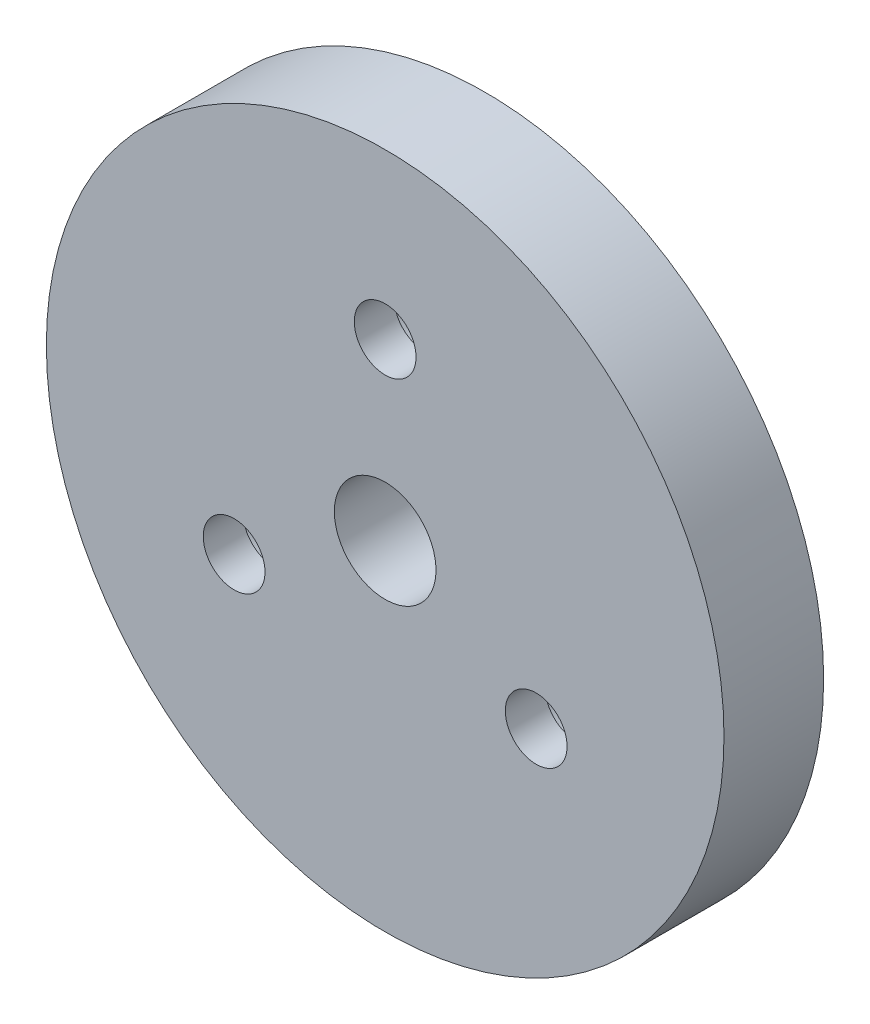
ISO-10303-21;
HEADER;
FILE_DESCRIPTION(('STEP AP214'),'2;1');
FILE_NAME('part.step','',(''),(''),'','','');
FILE_SCHEMA(('AUTOMOTIVE_DESIGN { 1 0 10303 214 1 1 1 1 }'));
ENDSEC;
DATA;
#1=APPLICATION_CONTEXT('core data for automotive mechanical design processes');
#2=APPLICATION_PROTOCOL_DEFINITION('international standard','automotive_design',2000,#1);
#3=PRODUCT_CONTEXT('',#1,'mechanical');
#4=PRODUCT('Part','Part','',(#3));
#5=PRODUCT_RELATED_PRODUCT_CATEGORY('part','',(#4));
#6=PRODUCT_DEFINITION_FORMATION('','',#4);
#7=PRODUCT_DEFINITION_CONTEXT('part definition',#1,'design');
#8=PRODUCT_DEFINITION('design','',#6,#7);
#9=PRODUCT_DEFINITION_SHAPE('','',#8);
#10=(LENGTH_UNIT() NAMED_UNIT(*) SI_UNIT(.MILLI.,.METRE.));
#11=(NAMED_UNIT(*) PLANE_ANGLE_UNIT() SI_UNIT($,.RADIAN.));
#12=(NAMED_UNIT(*) SI_UNIT($,.STERADIAN.) SOLID_ANGLE_UNIT());
#13=UNCERTAINTY_MEASURE_WITH_UNIT(LENGTH_MEASURE(1.E-05),#10,'distance_accuracy_value','');
#14=(GEOMETRIC_REPRESENTATION_CONTEXT(3) GLOBAL_UNCERTAINTY_ASSIGNED_CONTEXT((#13)) GLOBAL_UNIT_ASSIGNED_CONTEXT((#10,
#11,#12)) REPRESENTATION_CONTEXT('',''));
#15=CARTESIAN_POINT('',(0.,0.,0.));
#16=DIRECTION('',(0.,0.,1.));
#17=DIRECTION('',(1.,0.,0.));
#18=AXIS2_PLACEMENT_3D('',#15,#16,#17);
#19=CARTESIAN_POINT('',(0.,0.,5.));
#20=DIRECTION('',(0.,0.,-1.));
#21=DIRECTION('',(-1.,0.,0.));
#22=AXIS2_PLACEMENT_3D('',#19,#20,#21);
#23=CYLINDRICAL_SURFACE('',#22,17.);
#24=CARTESIAN_POINT('',(0.,0.,5.));
#25=DIRECTION('',(0.,0.,1.));
#26=DIRECTION('',(1.,0.,0.));
#27=AXIS2_PLACEMENT_3D('',#24,#25,#26);
#28=CIRCLE('',#27,17.);
#29=CARTESIAN_POINT('',(17.,0.,5.));
#30=VERTEX_POINT('',#29);
#31=EDGE_CURVE('E10',#30,#30,#28,.T.);
#32=ORIENTED_EDGE('',*,*,#31,.F.);
#33=EDGE_LOOP('',(#32));
#34=FACE_BOUND('',#33,.T.);
#35=CARTESIAN_POINT('',(0.,0.,0.));
#36=DIRECTION('',(0.,0.,1.));
#37=DIRECTION('',(1.,0.,0.));
#38=AXIS2_PLACEMENT_3D('',#35,#36,#37);
#39=CIRCLE('',#38,17.);
#40=CARTESIAN_POINT('',(17.,0.,0.));
#41=VERTEX_POINT('',#40);
#42=EDGE_CURVE('E44',#41,#41,#39,.T.);
#43=ORIENTED_EDGE('',*,*,#42,.T.);
#44=EDGE_LOOP('',(#43));
#45=FACE_BOUND('',#44,.T.);
#46=ADVANCED_FACE('F41',(#34,#45),#23,.T.);
#47=CARTESIAN_POINT('',(0.,0.,5.));
#48=DIRECTION('',(0.,0.,1.));
#49=DIRECTION('',(1.,0.,0.));
#50=AXIS2_PLACEMENT_3D('',#47,#48,#49);
#51=PLANE('',#50);
#52=CARTESIAN_POINT('',(7.57772228311382,-4.37500000000004,5.));
#53=DIRECTION('',(0.,0.,-1.));
#54=DIRECTION('',(-1.,0.,0.));
#55=AXIS2_PLACEMENT_3D('',#52,#53,#54);
#56=CIRCLE('',#55,1.55);
#57=CARTESIAN_POINT('',(6.02772228311382,-4.37500000000004,5.));
#58=VERTEX_POINT('',#57);
#59=EDGE_CURVE('E83',#58,#58,#56,.T.);
#60=ORIENTED_EDGE('',*,*,#59,.T.);
#61=EDGE_LOOP('',(#60));
#62=FACE_BOUND('',#61,.T.);
#63=CARTESIAN_POINT('',(0.,8.75,5.));
#64=DIRECTION('',(0.,0.,-1.));
#65=DIRECTION('',(-1.,0.,0.));
#66=AXIS2_PLACEMENT_3D('',#63,#64,#65);
#67=CIRCLE('',#66,1.55);
#68=CARTESIAN_POINT('',(-1.55,8.75,5.));
#69=VERTEX_POINT('',#68);
#70=EDGE_CURVE('E95',#69,#69,#67,.T.);
#71=ORIENTED_EDGE('',*,*,#70,.T.);
#72=EDGE_LOOP('',(#71));
#73=FACE_BOUND('',#72,.T.);
#74=CARTESIAN_POINT('',(-7.57772228311382,-4.37500000000004,5.));
#75=DIRECTION('',(0.,0.,-1.));
#76=DIRECTION('',(-1.,0.,0.));
#77=AXIS2_PLACEMENT_3D('',#74,#75,#76);
#78=CIRCLE('',#77,1.55);
#79=CARTESIAN_POINT('',(-9.12772228311382,-4.37500000000004,5.));
#80=VERTEX_POINT('',#79);
#81=EDGE_CURVE('E87',#80,#80,#78,.T.);
#82=ORIENTED_EDGE('',*,*,#81,.T.);
#83=EDGE_LOOP('',(#82));
#84=FACE_BOUND('',#83,.T.);
#85=CARTESIAN_POINT('',(0.,0.,5.));
#86=DIRECTION('',(0.,0.,-1.));
#87=DIRECTION('',(-1.,0.,0.));
#88=AXIS2_PLACEMENT_3D('',#85,#86,#87);
#89=CIRCLE('',#88,2.55);
#90=CARTESIAN_POINT('',(-2.55,0.,5.));
#91=VERTEX_POINT('',#90);
#92=EDGE_CURVE('E60',#91,#91,#89,.T.);
#93=ORIENTED_EDGE('',*,*,#92,.T.);
#94=EDGE_LOOP('',(#93));
#95=FACE_BOUND('',#94,.T.);
#96=ORIENTED_EDGE('',*,*,#31,.T.);
#97=EDGE_LOOP('',(#96));
#98=FACE_BOUND('',#97,.T.);
#99=ADVANCED_FACE('F111',(#62,#73,#84,#95,#98),#51,.T.);
#100=CARTESIAN_POINT('',(0.,0.,0.));
#101=DIRECTION('',(0.,0.,1.));
#102=DIRECTION('',(1.,0.,0.));
#103=AXIS2_PLACEMENT_3D('',#100,#101,#102);
#104=PLANE('',#103);
#105=CARTESIAN_POINT('',(0.,0.,0.));
#106=DIRECTION('',(0.,0.,-1.));
#107=DIRECTION('',(-1.,0.,0.));
#108=AXIS2_PLACEMENT_3D('',#105,#106,#107);
#109=CIRCLE('',#108,2.55);
#110=CARTESIAN_POINT('',(-2.55,0.,0.));
#111=VERTEX_POINT('',#110);
#112=EDGE_CURVE('E79',#111,#111,#109,.T.);
#113=ORIENTED_EDGE('',*,*,#112,.F.);
#114=EDGE_LOOP('',(#113));
#115=FACE_BOUND('',#114,.T.);
#116=CARTESIAN_POINT('',(0.,8.75,0.));
#117=DIRECTION('',(0.,0.,-1.));
#118=DIRECTION('',(-1.,0.,0.));
#119=AXIS2_PLACEMENT_3D('',#116,#117,#118);
#120=CIRCLE('',#119,2.8);
#121=CARTESIAN_POINT('',(-2.8,8.75,0.));
#122=VERTEX_POINT('',#121);
#123=EDGE_CURVE('E72',#122,#122,#120,.T.);
#124=ORIENTED_EDGE('',*,*,#123,.F.);
#125=EDGE_LOOP('',(#124));
#126=FACE_BOUND('',#125,.T.);
#127=CARTESIAN_POINT('',(-7.57772228311385,-4.37499999999998,0.));
#128=DIRECTION('',(0.,0.,-1.));
#129=DIRECTION('',(-1.,0.,0.));
#130=AXIS2_PLACEMENT_3D('',#127,#128,#129);
#131=CIRCLE('',#130,2.8);
#132=CARTESIAN_POINT('',(-10.3777222831139,-4.37499999999998,0.));
#133=VERTEX_POINT('',#132);
#134=EDGE_CURVE('E68',#133,#133,#131,.T.);
#135=ORIENTED_EDGE('',*,*,#134,.F.);
#136=EDGE_LOOP('',(#135));
#137=FACE_BOUND('',#136,.T.);
#138=CARTESIAN_POINT('',(7.57772228311385,-4.37499999999999,0.));
#139=DIRECTION('',(0.,0.,-1.));
#140=DIRECTION('',(-1.,0.,0.));
#141=AXIS2_PLACEMENT_3D('',#138,#139,#140);
#142=CIRCLE('',#141,2.8);
#143=CARTESIAN_POINT('',(4.77772228311385,-4.37499999999999,0.));
#144=VERTEX_POINT('',#143);
#145=EDGE_CURVE('E59',#144,#144,#142,.T.);
#146=ORIENTED_EDGE('',*,*,#145,.F.);
#147=EDGE_LOOP('',(#146));
#148=FACE_BOUND('',#147,.T.);
#149=ORIENTED_EDGE('',*,*,#42,.F.);
#150=EDGE_LOOP('',(#149));
#151=FACE_BOUND('',#150,.T.);
#152=ADVANCED_FACE('F131',(#115,#126,#137,#148,#151),#104,.F.);
#153=CARTESIAN_POINT('',(7.57772228311385,-4.37499999999999,3.));
#154=DIRECTION('',(0.,0.,-1.));
#155=DIRECTION('',(-1.,0.,0.));
#156=AXIS2_PLACEMENT_3D('',#153,#154,#155);
#157=CYLINDRICAL_SURFACE('',#156,2.8);
#158=CARTESIAN_POINT('',(7.57772228311385,-4.37499999999999,3.));
#159=DIRECTION('',(0.,0.,-1.));
#160=DIRECTION('',(-1.,0.,0.));
#161=AXIS2_PLACEMENT_3D('',#158,#159,#160);
#162=CIRCLE('',#161,2.8);
#163=CARTESIAN_POINT('',(4.77772228311385,-4.37499999999999,3.));
#164=VERTEX_POINT('',#163);
#165=EDGE_CURVE('E55',#164,#164,#162,.T.);
#166=ORIENTED_EDGE('',*,*,#165,.F.);
#167=EDGE_LOOP('',(#166));
#168=FACE_BOUND('',#167,.T.);
#169=ORIENTED_EDGE('',*,*,#145,.T.);
#170=EDGE_LOOP('',(#169));
#171=FACE_BOUND('',#170,.T.);
#172=ADVANCED_FACE('F125',(#168,#171),#157,.F.);
#173=CARTESIAN_POINT('',(7.57772228311385,-4.37499999999999,3.));
#174=DIRECTION('',(0.,0.,-1.));
#175=DIRECTION('',(-1.,0.,0.));
#176=AXIS2_PLACEMENT_3D('',#173,#174,#175);
#177=PLANE('',#176);
#178=CARTESIAN_POINT('',(7.57772228311382,-4.37500000000004,3.));
#179=DIRECTION('',(0.,0.,-1.));
#180=DIRECTION('',(-1.,0.,0.));
#181=AXIS2_PLACEMENT_3D('',#178,#179,#180);
#182=CIRCLE('',#181,1.55);
#183=CARTESIAN_POINT('',(6.02772228311382,-4.37500000000004,3.));
#184=VERTEX_POINT('',#183);
#185=EDGE_CURVE('E103',#184,#184,#182,.T.);
#186=ORIENTED_EDGE('',*,*,#185,.F.);
#187=EDGE_LOOP('',(#186));
#188=FACE_BOUND('',#187,.T.);
#189=ORIENTED_EDGE('',*,*,#165,.T.);
#190=EDGE_LOOP('',(#189));
#191=FACE_BOUND('',#190,.T.);
#192=ADVANCED_FACE('F121',(#188,#191),#177,.T.);
#193=CARTESIAN_POINT('',(-7.57772228311385,-4.37499999999998,3.));
#194=DIRECTION('',(0.,0.,-1.));
#195=DIRECTION('',(-1.,0.,0.));
#196=AXIS2_PLACEMENT_3D('',#193,#194,#195);
#197=CYLINDRICAL_SURFACE('',#196,2.8);
#198=CARTESIAN_POINT('',(-7.57772228311385,-4.37499999999998,3.));
#199=DIRECTION('',(0.,0.,-1.));
#200=DIRECTION('',(-1.,0.,0.));
#201=AXIS2_PLACEMENT_3D('',#198,#199,#200);
#202=CIRCLE('',#201,2.8);
#203=CARTESIAN_POINT('',(-10.3777222831139,-4.37499999999998,3.));
#204=VERTEX_POINT('',#203);
#205=EDGE_CURVE('E64',#204,#204,#202,.T.);
#206=ORIENTED_EDGE('',*,*,#205,.F.);
#207=EDGE_LOOP('',(#206));
#208=FACE_BOUND('',#207,.T.);
#209=ORIENTED_EDGE('',*,*,#134,.T.);
#210=EDGE_LOOP('',(#209));
#211=FACE_BOUND('',#210,.T.);
#212=ADVANCED_FACE('F124',(#208,#211),#197,.F.);
#213=CARTESIAN_POINT('',(-7.57772228311385,-4.37499999999998,3.));
#214=DIRECTION('',(0.,0.,-1.));
#215=DIRECTION('',(-1.,0.,0.));
#216=AXIS2_PLACEMENT_3D('',#213,#214,#215);
#217=PLANE('',#216);
#218=CARTESIAN_POINT('',(-7.57772228311382,-4.37500000000004,3.));
#219=DIRECTION('',(0.,0.,-1.));
#220=DIRECTION('',(-1.,0.,0.));
#221=AXIS2_PLACEMENT_3D('',#218,#219,#220);
#222=CIRCLE('',#221,1.55);
#223=CARTESIAN_POINT('',(-9.12772228311382,-4.37500000000004,3.));
#224=VERTEX_POINT('',#223);
#225=EDGE_CURVE('E91',#224,#224,#222,.T.);
#226=ORIENTED_EDGE('',*,*,#225,.F.);
#227=EDGE_LOOP('',(#226));
#228=FACE_BOUND('',#227,.T.);
#229=ORIENTED_EDGE('',*,*,#205,.T.);
#230=EDGE_LOOP('',(#229));
#231=FACE_BOUND('',#230,.T.);
#232=ADVANCED_FACE('F149',(#228,#231),#217,.T.);
#233=CARTESIAN_POINT('',(0.,8.75,3.));
#234=DIRECTION('',(0.,0.,-1.));
#235=DIRECTION('',(-1.,0.,0.));
#236=AXIS2_PLACEMENT_3D('',#233,#234,#235);
#237=CYLINDRICAL_SURFACE('',#236,2.8);
#238=CARTESIAN_POINT('',(0.,8.75,3.));
#239=DIRECTION('',(0.,0.,-1.));
#240=DIRECTION('',(-1.,0.,0.));
#241=AXIS2_PLACEMENT_3D('',#238,#239,#240);
#242=CIRCLE('',#241,2.8);
#243=CARTESIAN_POINT('',(-2.8,8.75,3.));
#244=VERTEX_POINT('',#243);
#245=EDGE_CURVE('E53',#244,#244,#242,.T.);
#246=ORIENTED_EDGE('',*,*,#245,.F.);
#247=EDGE_LOOP('',(#246));
#248=FACE_BOUND('',#247,.T.);
#249=ORIENTED_EDGE('',*,*,#123,.T.);
#250=EDGE_LOOP('',(#249));
#251=FACE_BOUND('',#250,.T.);
#252=ADVANCED_FACE('F152',(#248,#251),#237,.F.);
#253=CARTESIAN_POINT('',(0.,8.75,3.));
#254=DIRECTION('',(0.,0.,-1.));
#255=DIRECTION('',(-1.,0.,0.));
#256=AXIS2_PLACEMENT_3D('',#253,#254,#255);
#257=PLANE('',#256);
#258=CARTESIAN_POINT('',(0.,8.75,3.));
#259=DIRECTION('',(0.,0.,-1.));
#260=DIRECTION('',(-1.,0.,0.));
#261=AXIS2_PLACEMENT_3D('',#258,#259,#260);
#262=CIRCLE('',#261,1.55);
#263=CARTESIAN_POINT('',(-1.55,8.75,3.));
#264=VERTEX_POINT('',#263);
#265=EDGE_CURVE('E99',#264,#264,#262,.T.);
#266=ORIENTED_EDGE('',*,*,#265,.F.);
#267=EDGE_LOOP('',(#266));
#268=FACE_BOUND('',#267,.T.);
#269=ORIENTED_EDGE('',*,*,#245,.T.);
#270=EDGE_LOOP('',(#269));
#271=FACE_BOUND('',#270,.T.);
#272=ADVANCED_FACE('F159',(#268,#271),#257,.T.);
#273=CARTESIAN_POINT('',(0.,0.,5.));
#274=DIRECTION('',(0.,0.,-1.));
#275=DIRECTION('',(-1.,0.,0.));
#276=AXIS2_PLACEMENT_3D('',#273,#274,#275);
#277=CYLINDRICAL_SURFACE('',#276,2.55);
#278=ORIENTED_EDGE('',*,*,#92,.F.);
#279=EDGE_LOOP('',(#278));
#280=FACE_BOUND('',#279,.T.);
#281=ORIENTED_EDGE('',*,*,#112,.T.);
#282=EDGE_LOOP('',(#281));
#283=FACE_BOUND('',#282,.T.);
#284=ADVANCED_FACE('F163',(#280,#283),#277,.F.);
#285=CARTESIAN_POINT('',(-7.57772228311382,-4.37500000000004,5.));
#286=DIRECTION('',(0.,0.,-1.));
#287=DIRECTION('',(-1.,0.,0.));
#288=AXIS2_PLACEMENT_3D('',#285,#286,#287);
#289=CYLINDRICAL_SURFACE('',#288,1.55);
#290=ORIENTED_EDGE('',*,*,#81,.F.);
#291=EDGE_LOOP('',(#290));
#292=FACE_BOUND('',#291,.T.);
#293=ORIENTED_EDGE('',*,*,#225,.T.);
#294=EDGE_LOOP('',(#293));
#295=FACE_BOUND('',#294,.T.);
#296=ADVANCED_FACE('F167',(#292,#295),#289,.F.);
#297=CARTESIAN_POINT('',(0.,8.75,5.));
#298=DIRECTION('',(0.,0.,-1.));
#299=DIRECTION('',(-1.,0.,0.));
#300=AXIS2_PLACEMENT_3D('',#297,#298,#299);
#301=CYLINDRICAL_SURFACE('',#300,1.55);
#302=ORIENTED_EDGE('',*,*,#70,.F.);
#303=EDGE_LOOP('',(#302));
#304=FACE_BOUND('',#303,.T.);
#305=ORIENTED_EDGE('',*,*,#265,.T.);
#306=EDGE_LOOP('',(#305));
#307=FACE_BOUND('',#306,.T.);
#308=ADVANCED_FACE('F117',(#304,#307),#301,.F.);
#309=CARTESIAN_POINT('',(7.57772228311382,-4.37500000000004,5.));
#310=DIRECTION('',(0.,0.,-1.));
#311=DIRECTION('',(-1.,0.,0.));
#312=AXIS2_PLACEMENT_3D('',#309,#310,#311);
#313=CYLINDRICAL_SURFACE('',#312,1.55);
#314=ORIENTED_EDGE('',*,*,#59,.F.);
#315=EDGE_LOOP('',(#314));
#316=FACE_BOUND('',#315,.T.);
#317=ORIENTED_EDGE('',*,*,#185,.T.);
#318=EDGE_LOOP('',(#317));
#319=FACE_BOUND('',#318,.T.);
#320=ADVANCED_FACE('F114',(#316,#319),#313,.F.);
#321=CLOSED_SHELL('',(#46,#99,#152,#172,#192,#212,#232,#252,#272,#284,#296,#308,#320));
#322=MANIFOLD_SOLID_BREP('B2',#321);
#323=ADVANCED_BREP_SHAPE_REPRESENTATION('',(#18,#322),#14);
#324=SHAPE_DEFINITION_REPRESENTATION(#9,#323);
ENDSEC;
END-ISO-10303-21;
